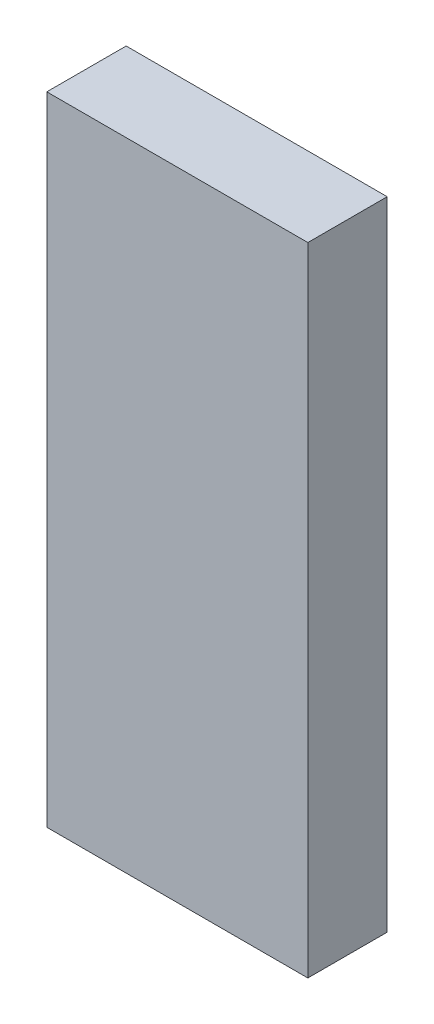
ISO-10303-21;
HEADER;
FILE_DESCRIPTION(('STEP AP214'),'2;1');
FILE_NAME('part.step','',(''),(''),'','','');
FILE_SCHEMA(('AUTOMOTIVE_DESIGN { 1 0 10303 214 1 1 1 1 }'));
ENDSEC;
DATA;
#1=APPLICATION_CONTEXT('core data for automotive mechanical design processes');
#2=APPLICATION_PROTOCOL_DEFINITION('international standard','automotive_design',2000,#1);
#3=PRODUCT_CONTEXT('',#1,'mechanical');
#4=PRODUCT('Part','Part','',(#3));
#5=PRODUCT_RELATED_PRODUCT_CATEGORY('part','',(#4));
#6=PRODUCT_DEFINITION_FORMATION('','',#4);
#7=PRODUCT_DEFINITION_CONTEXT('part definition',#1,'design');
#8=PRODUCT_DEFINITION('design','',#6,#7);
#9=PRODUCT_DEFINITION_SHAPE('','',#8);
#10=(LENGTH_UNIT() NAMED_UNIT(*) SI_UNIT(.MILLI.,.METRE.));
#11=(NAMED_UNIT(*) PLANE_ANGLE_UNIT() SI_UNIT($,.RADIAN.));
#12=(NAMED_UNIT(*) SI_UNIT($,.STERADIAN.) SOLID_ANGLE_UNIT());
#13=UNCERTAINTY_MEASURE_WITH_UNIT(LENGTH_MEASURE(1.E-05),#10,'distance_accuracy_value','');
#14=(GEOMETRIC_REPRESENTATION_CONTEXT(3) GLOBAL_UNCERTAINTY_ASSIGNED_CONTEXT((#13)) GLOBAL_UNIT_ASSIGNED_CONTEXT((#10,
#11,#12)) REPRESENTATION_CONTEXT('',''));
#15=CARTESIAN_POINT('',(0.,0.,0.));
#16=DIRECTION('',(0.,0.,1.));
#17=DIRECTION('',(1.,0.,0.));
#18=AXIS2_PLACEMENT_3D('',#15,#16,#17);
#19=CARTESIAN_POINT('',(0.62500002,1.52500076,0.37999924));
#20=DIRECTION('',(0.,0.,1.));
#21=DIRECTION('',(1.,0.,0.));
#22=AXIS2_PLACEMENT_3D('',#19,#20,#21);
#23=PLANE('',#22);
#24=DIRECTION('',(1.,0.,0.));
#25=VECTOR('',#24,1.);
#26=CARTESIAN_POINT('',(-0.62500002,1.52500076,0.37999924));
#27=LINE('',#26,#25);
#28=CARTESIAN_POINT('',(-0.62500002,1.52500076,0.37999924));
#29=VERTEX_POINT('',#28);
#30=CARTESIAN_POINT('',(0.62500002,1.52500076,0.37999924));
#31=VERTEX_POINT('',#30);
#32=EDGE_CURVE('E27',#29,#31,#27,.T.);
#33=ORIENTED_EDGE('',*,*,#32,.F.);
#34=DIRECTION('',(0.,1.,0.));
#35=VECTOR('',#34,1.);
#36=CARTESIAN_POINT('',(-0.62500002,-1.52499822,0.37999924));
#37=LINE('',#36,#35);
#38=CARTESIAN_POINT('',(-0.62500002,-1.52499822,0.37999924));
#39=VERTEX_POINT('',#38);
#40=EDGE_CURVE('E102',#39,#29,#37,.T.);
#41=ORIENTED_EDGE('',*,*,#40,.F.);
#42=DIRECTION('',(-1.,0.,0.));
#43=VECTOR('',#42,1.);
#44=CARTESIAN_POINT('',(0.62500002,-1.52499822,0.37999924));
#45=LINE('',#44,#43);
#46=CARTESIAN_POINT('',(0.62500002,-1.52499822,0.37999924));
#47=VERTEX_POINT('',#46);
#48=EDGE_CURVE('E73',#47,#39,#45,.T.);
#49=ORIENTED_EDGE('',*,*,#48,.F.);
#50=DIRECTION('',(0.,-1.,0.));
#51=VECTOR('',#50,1.);
#52=CARTESIAN_POINT('',(0.62500002,1.52500076,0.37999924));
#53=LINE('',#52,#51);
#54=EDGE_CURVE('E20',#31,#47,#53,.T.);
#55=ORIENTED_EDGE('',*,*,#54,.F.);
#56=EDGE_LOOP('',(#33,#41,#49,#55));
#57=FACE_BOUND('',#56,.T.);
#58=ADVANCED_FACE('F16',(#57),#23,.T.);
#59=CARTESIAN_POINT('',(0.62500002,1.52500076,0.));
#60=DIRECTION('',(0.,0.,1.));
#61=DIRECTION('',(1.,0.,0.));
#62=AXIS2_PLACEMENT_3D('',#59,#60,#61);
#63=PLANE('',#62);
#64=DIRECTION('',(0.,-1.,0.));
#65=VECTOR('',#64,1.);
#66=CARTESIAN_POINT('',(0.62500002,1.52500076,0.));
#67=LINE('',#66,#65);
#68=CARTESIAN_POINT('',(0.62500002,1.52500076,0.));
#69=VERTEX_POINT('',#68);
#70=CARTESIAN_POINT('',(0.62500002,-1.52499822,0.));
#71=VERTEX_POINT('',#70);
#72=EDGE_CURVE('E93',#69,#71,#67,.T.);
#73=ORIENTED_EDGE('',*,*,#72,.T.);
#74=DIRECTION('',(-1.,0.,0.));
#75=VECTOR('',#74,1.);
#76=CARTESIAN_POINT('',(0.62500002,-1.52499822,0.));
#77=LINE('',#76,#75);
#78=CARTESIAN_POINT('',(-0.62500002,-1.52499822,0.));
#79=VERTEX_POINT('',#78);
#80=EDGE_CURVE('E64',#71,#79,#77,.T.);
#81=ORIENTED_EDGE('',*,*,#80,.T.);
#82=DIRECTION('',(0.,1.,0.));
#83=VECTOR('',#82,1.);
#84=CARTESIAN_POINT('',(-0.62500002,-1.52499822,0.));
#85=LINE('',#84,#83);
#86=CARTESIAN_POINT('',(-0.62500002,1.52500076,0.));
#87=VERTEX_POINT('',#86);
#88=EDGE_CURVE('E84',#79,#87,#85,.T.);
#89=ORIENTED_EDGE('',*,*,#88,.T.);
#90=DIRECTION('',(1.,0.,0.));
#91=VECTOR('',#90,1.);
#92=CARTESIAN_POINT('',(-0.62500002,1.52500076,0.));
#93=LINE('',#92,#91);
#94=EDGE_CURVE('E10',#87,#69,#93,.T.);
#95=ORIENTED_EDGE('',*,*,#94,.T.);
#96=EDGE_LOOP('',(#73,#81,#89,#95));
#97=FACE_BOUND('',#96,.T.);
#98=ADVANCED_FACE('F18',(#97),#63,.F.);
#99=CARTESIAN_POINT('',(-0.62500002,1.52500076,0.));
#100=DIRECTION('',(0.,1.,0.));
#101=DIRECTION('',(1.,0.,0.));
#102=AXIS2_PLACEMENT_3D('',#99,#100,#101);
#103=PLANE('',#102);
#104=DIRECTION('',(0.,0.,1.));
#105=VECTOR('',#104,1.);
#106=CARTESIAN_POINT('',(-0.62500002,1.52500076,0.));
#107=LINE('',#106,#105);
#108=EDGE_CURVE('E81',#87,#29,#107,.T.);
#109=ORIENTED_EDGE('',*,*,#108,.T.);
#110=ORIENTED_EDGE('',*,*,#32,.T.);
#111=DIRECTION('',(0.,0.,1.));
#112=VECTOR('',#111,1.);
#113=CARTESIAN_POINT('',(0.62500002,1.52500076,0.));
#114=LINE('',#113,#112);
#115=EDGE_CURVE('E79',#69,#31,#114,.T.);
#116=ORIENTED_EDGE('',*,*,#115,.F.);
#117=ORIENTED_EDGE('',*,*,#94,.F.);
#118=EDGE_LOOP('',(#109,#110,#116,#117));
#119=FACE_BOUND('',#118,.T.);
#120=ADVANCED_FACE('F77',(#119),#103,.T.);
#121=CARTESIAN_POINT('',(-0.62500002,-1.52499822,0.));
#122=DIRECTION('',(-1.,0.,0.));
#123=DIRECTION('',(0.,0.,1.));
#124=AXIS2_PLACEMENT_3D('',#121,#122,#123);
#125=PLANE('',#124);
#126=DIRECTION('',(0.,0.,1.));
#127=VECTOR('',#126,1.);
#128=CARTESIAN_POINT('',(-0.62500002,-1.52499822,0.));
#129=LINE('',#128,#127);
#130=EDGE_CURVE('E114',#79,#39,#129,.T.);
#131=ORIENTED_EDGE('',*,*,#130,.T.);
#132=ORIENTED_EDGE('',*,*,#40,.T.);
#133=ORIENTED_EDGE('',*,*,#108,.F.);
#134=ORIENTED_EDGE('',*,*,#88,.F.);
#135=EDGE_LOOP('',(#131,#132,#133,#134));
#136=FACE_BOUND('',#135,.T.);
#137=ADVANCED_FACE('F128',(#136),#125,.T.);
#138=CARTESIAN_POINT('',(0.62500002,-1.52499822,0.));
#139=DIRECTION('',(0.,-1.,0.));
#140=DIRECTION('',(0.,0.,-1.));
#141=AXIS2_PLACEMENT_3D('',#138,#139,#140);
#142=PLANE('',#141);
#143=DIRECTION('',(0.,0.,1.));
#144=VECTOR('',#143,1.);
#145=CARTESIAN_POINT('',(0.62500002,-1.52499822,0.));
#146=LINE('',#145,#144);
#147=EDGE_CURVE('E90',#71,#47,#146,.T.);
#148=ORIENTED_EDGE('',*,*,#147,.T.);
#149=ORIENTED_EDGE('',*,*,#48,.T.);
#150=ORIENTED_EDGE('',*,*,#130,.F.);
#151=ORIENTED_EDGE('',*,*,#80,.F.);
#152=EDGE_LOOP('',(#148,#149,#150,#151));
#153=FACE_BOUND('',#152,.T.);
#154=ADVANCED_FACE('F127',(#153),#142,.T.);
#155=CARTESIAN_POINT('',(0.62500002,1.52500076,0.));
#156=DIRECTION('',(1.,0.,0.));
#157=DIRECTION('',(0.,1.,0.));
#158=AXIS2_PLACEMENT_3D('',#155,#156,#157);
#159=PLANE('',#158);
#160=ORIENTED_EDGE('',*,*,#115,.T.);
#161=ORIENTED_EDGE('',*,*,#54,.T.);
#162=ORIENTED_EDGE('',*,*,#147,.F.);
#163=ORIENTED_EDGE('',*,*,#72,.F.);
#164=EDGE_LOOP('',(#160,#161,#162,#163));
#165=FACE_BOUND('',#164,.T.);
#166=ADVANCED_FACE('F92',(#165),#159,.T.);
#167=CLOSED_SHELL('',(#58,#98,#120,#137,#154,#166));
#168=MANIFOLD_SOLID_BREP('B1',#167);
#169=ADVANCED_BREP_SHAPE_REPRESENTATION('',(#18,#168),#14);
#170=SHAPE_DEFINITION_REPRESENTATION(#9,#169);
ENDSEC;
END-ISO-10303-21;
